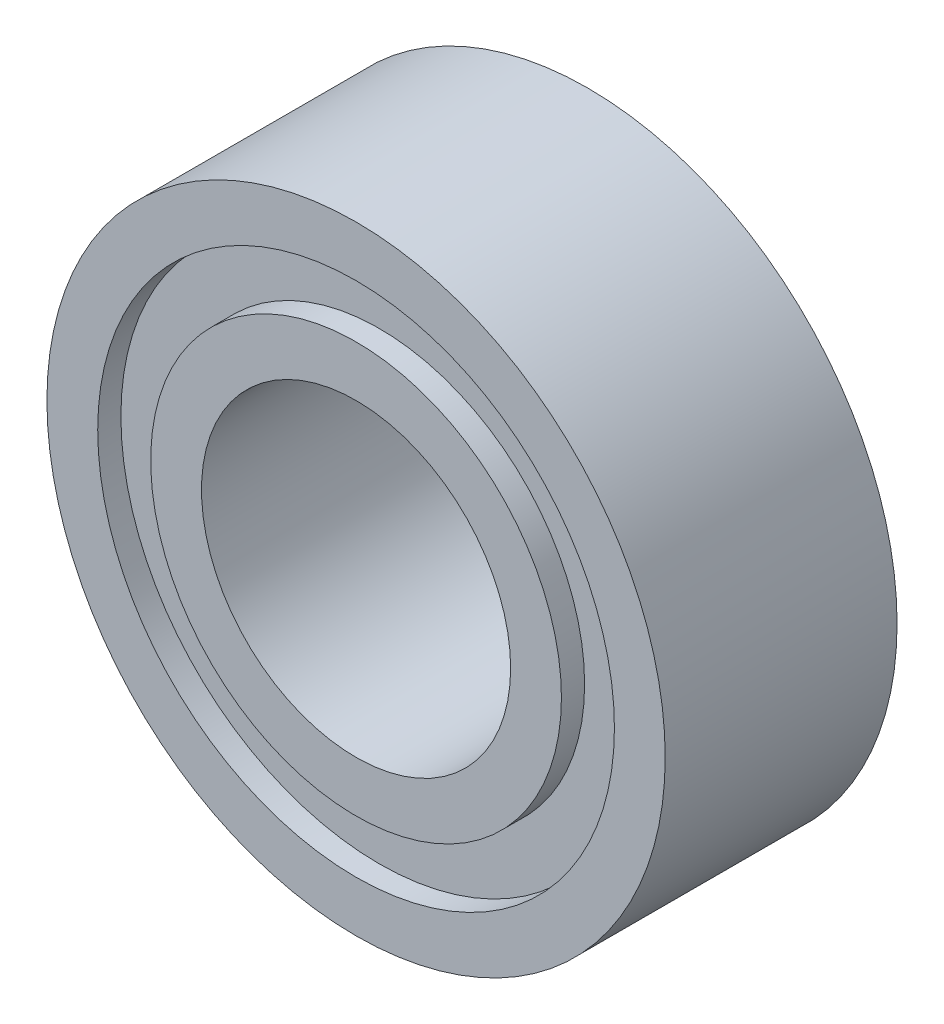
ISO-10303-21;
HEADER;
FILE_DESCRIPTION(('STEP AP214'),'2;1');
FILE_NAME('part.step','',(''),(''),'','','');
FILE_SCHEMA(('AUTOMOTIVE_DESIGN { 1 0 10303 214 1 1 1 1 }'));
ENDSEC;
DATA;
#1=APPLICATION_CONTEXT('core data for automotive mechanical design processes');
#2=APPLICATION_PROTOCOL_DEFINITION('international standard','automotive_design',2000,#1);
#3=PRODUCT_CONTEXT('',#1,'mechanical');
#4=PRODUCT('Part','Part','',(#3));
#5=PRODUCT_RELATED_PRODUCT_CATEGORY('part','',(#4));
#6=PRODUCT_DEFINITION_FORMATION('','',#4);
#7=PRODUCT_DEFINITION_CONTEXT('part definition',#1,'design');
#8=PRODUCT_DEFINITION('design','',#6,#7);
#9=PRODUCT_DEFINITION_SHAPE('','',#8);
#10=(LENGTH_UNIT() NAMED_UNIT(*) SI_UNIT(.MILLI.,.METRE.));
#11=(NAMED_UNIT(*) PLANE_ANGLE_UNIT() SI_UNIT($,.RADIAN.));
#12=(NAMED_UNIT(*) SI_UNIT($,.STERADIAN.) SOLID_ANGLE_UNIT());
#13=UNCERTAINTY_MEASURE_WITH_UNIT(LENGTH_MEASURE(1.E-05),#10,'distance_accuracy_value','');
#14=(GEOMETRIC_REPRESENTATION_CONTEXT(3) GLOBAL_UNCERTAINTY_ASSIGNED_CONTEXT((#13)) GLOBAL_UNIT_ASSIGNED_CONTEXT((#10,
#11,#12)) REPRESENTATION_CONTEXT('',''));
#15=CARTESIAN_POINT('',(0.,0.,0.));
#16=DIRECTION('',(0.,0.,1.));
#17=DIRECTION('',(1.,0.,0.));
#18=AXIS2_PLACEMENT_3D('',#15,#16,#17);
#19=CARTESIAN_POINT('',(0.,2.,1.5));
#20=DIRECTION('',(0.,0.,-1.));
#21=DIRECTION('',(-1.,0.,0.));
#22=AXIS2_PLACEMENT_3D('',#19,#20,#21);
#23=PLANE('',#22);
#24=CARTESIAN_POINT('',(0.,0.,1.5));
#25=DIRECTION('',(0.,0.,1.));
#26=DIRECTION('',(1.,0.,0.));
#27=AXIS2_PLACEMENT_3D('',#24,#25,#26);
#28=CIRCLE('',#27,2.);
#29=CARTESIAN_POINT('',(2.,0.,1.5));
#30=VERTEX_POINT('',#29);
#31=EDGE_CURVE('E100',#30,#30,#28,.T.);
#32=ORIENTED_EDGE('',*,*,#31,.F.);
#33=EDGE_LOOP('',(#32));
#34=FACE_BOUND('',#33,.T.);
#35=CARTESIAN_POINT('',(0.,0.,1.5));
#36=DIRECTION('',(0.,0.,1.));
#37=DIRECTION('',(1.,0.,0.));
#38=AXIS2_PLACEMENT_3D('',#35,#36,#37);
#39=CIRCLE('',#38,2.65714285714296);
#40=CARTESIAN_POINT('',(2.65714285714296,0.,1.5));
#41=VERTEX_POINT('',#40);
#42=EDGE_CURVE('E67',#41,#41,#39,.T.);
#43=ORIENTED_EDGE('',*,*,#42,.T.);
#44=EDGE_LOOP('',(#43));
#45=FACE_BOUND('',#44,.T.);
#46=ADVANCED_FACE('F34',(#34,#45),#23,.F.);
#47=CARTESIAN_POINT('',(0.,0.,0.));
#48=DIRECTION('',(0.,0.,1.));
#49=DIRECTION('',(1.,0.,0.));
#50=AXIS2_PLACEMENT_3D('',#47,#48,#49);
#51=CYLINDRICAL_SURFACE('',#50,2.65714285714296);
#52=ORIENTED_EDGE('',*,*,#42,.F.);
#53=EDGE_LOOP('',(#52));
#54=FACE_BOUND('',#53,.T.);
#55=CARTESIAN_POINT('',(0.,0.,1.2));
#56=DIRECTION('',(0.,0.,1.));
#57=DIRECTION('',(1.,0.,0.));
#58=AXIS2_PLACEMENT_3D('',#55,#56,#57);
#59=CIRCLE('',#58,2.65714285714296);
#60=CARTESIAN_POINT('',(2.65714285714296,0.,1.2));
#61=VERTEX_POINT('',#60);
#62=EDGE_CURVE('E70',#61,#61,#59,.T.);
#63=ORIENTED_EDGE('',*,*,#62,.T.);
#64=EDGE_LOOP('',(#63));
#65=FACE_BOUND('',#64,.T.);
#66=ADVANCED_FACE('F108',(#54,#65),#51,.T.);
#67=CARTESIAN_POINT('',(0.,3.34285714285704,1.2));
#68=DIRECTION('',(0.,0.,-1.));
#69=DIRECTION('',(-1.,0.,0.));
#70=AXIS2_PLACEMENT_3D('',#67,#68,#69);
#71=PLANE('',#70);
#72=ORIENTED_EDGE('',*,*,#62,.F.);
#73=EDGE_LOOP('',(#72));
#74=FACE_BOUND('',#73,.T.);
#75=CARTESIAN_POINT('',(0.,0.,1.2));
#76=DIRECTION('',(0.,0.,1.));
#77=DIRECTION('',(1.,0.,0.));
#78=AXIS2_PLACEMENT_3D('',#75,#76,#77);
#79=CIRCLE('',#78,3.34285714285704);
#80=CARTESIAN_POINT('',(3.34285714285704,0.,1.2));
#81=VERTEX_POINT('',#80);
#82=EDGE_CURVE('E73',#81,#81,#79,.T.);
#83=ORIENTED_EDGE('',*,*,#82,.T.);
#84=EDGE_LOOP('',(#83));
#85=FACE_BOUND('',#84,.T.);
#86=ADVANCED_FACE('F114',(#74,#85),#71,.F.);
#87=CARTESIAN_POINT('',(0.,0.,0.));
#88=DIRECTION('',(0.,0.,1.));
#89=DIRECTION('',(1.,0.,0.));
#90=AXIS2_PLACEMENT_3D('',#87,#88,#89);
#91=CYLINDRICAL_SURFACE('',#90,3.34285714285704);
#92=ORIENTED_EDGE('',*,*,#82,.F.);
#93=EDGE_LOOP('',(#92));
#94=FACE_BOUND('',#93,.T.);
#95=CARTESIAN_POINT('',(0.,0.,1.5));
#96=DIRECTION('',(0.,0.,1.));
#97=DIRECTION('',(1.,0.,0.));
#98=AXIS2_PLACEMENT_3D('',#95,#96,#97);
#99=CIRCLE('',#98,3.34285714285704);
#100=CARTESIAN_POINT('',(3.34285714285704,0.,1.5));
#101=VERTEX_POINT('',#100);
#102=EDGE_CURVE('E76',#101,#101,#99,.T.);
#103=ORIENTED_EDGE('',*,*,#102,.T.);
#104=EDGE_LOOP('',(#103));
#105=FACE_BOUND('',#104,.T.);
#106=ADVANCED_FACE('F120',(#94,#105),#91,.F.);
#107=CARTESIAN_POINT('',(0.,4.,1.5));
#108=DIRECTION('',(0.,0.,-1.));
#109=DIRECTION('',(-1.,0.,0.));
#110=AXIS2_PLACEMENT_3D('',#107,#108,#109);
#111=PLANE('',#110);
#112=ORIENTED_EDGE('',*,*,#102,.F.);
#113=EDGE_LOOP('',(#112));
#114=FACE_BOUND('',#113,.T.);
#115=CARTESIAN_POINT('',(0.,0.,1.5));
#116=DIRECTION('',(0.,0.,1.));
#117=DIRECTION('',(1.,0.,0.));
#118=AXIS2_PLACEMENT_3D('',#115,#116,#117);
#119=CIRCLE('',#118,4.);
#120=CARTESIAN_POINT('',(4.,0.,1.5));
#121=VERTEX_POINT('',#120);
#122=EDGE_CURVE('E79',#121,#121,#119,.T.);
#123=ORIENTED_EDGE('',*,*,#122,.T.);
#124=EDGE_LOOP('',(#123));
#125=FACE_BOUND('',#124,.T.);
#126=ADVANCED_FACE('F126',(#114,#125),#111,.F.);
#127=CARTESIAN_POINT('',(0.,0.,0.));
#128=DIRECTION('',(0.,0.,1.));
#129=DIRECTION('',(1.,0.,0.));
#130=AXIS2_PLACEMENT_3D('',#127,#128,#129);
#131=CYLINDRICAL_SURFACE('',#130,4.);
#132=ORIENTED_EDGE('',*,*,#122,.F.);
#133=EDGE_LOOP('',(#132));
#134=FACE_BOUND('',#133,.T.);
#135=CARTESIAN_POINT('',(0.,0.,-1.5));
#136=DIRECTION('',(0.,0.,1.));
#137=DIRECTION('',(1.,0.,0.));
#138=AXIS2_PLACEMENT_3D('',#135,#136,#137);
#139=CIRCLE('',#138,4.);
#140=CARTESIAN_POINT('',(4.,0.,-1.5));
#141=VERTEX_POINT('',#140);
#142=EDGE_CURVE('E82',#141,#141,#139,.T.);
#143=ORIENTED_EDGE('',*,*,#142,.T.);
#144=EDGE_LOOP('',(#143));
#145=FACE_BOUND('',#144,.T.);
#146=ADVANCED_FACE('F132',(#134,#145),#131,.T.);
#147=CARTESIAN_POINT('',(0.,3.34285714285704,-1.5));
#148=DIRECTION('',(0.,0.,1.));
#149=DIRECTION('',(1.,0.,0.));
#150=AXIS2_PLACEMENT_3D('',#147,#148,#149);
#151=PLANE('',#150);
#152=ORIENTED_EDGE('',*,*,#142,.F.);
#153=EDGE_LOOP('',(#152));
#154=FACE_BOUND('',#153,.T.);
#155=CARTESIAN_POINT('',(0.,0.,-1.5));
#156=DIRECTION('',(0.,0.,1.));
#157=DIRECTION('',(1.,0.,0.));
#158=AXIS2_PLACEMENT_3D('',#155,#156,#157);
#159=CIRCLE('',#158,3.34285714285704);
#160=CARTESIAN_POINT('',(3.34285714285704,0.,-1.5));
#161=VERTEX_POINT('',#160);
#162=EDGE_CURVE('E85',#161,#161,#159,.T.);
#163=ORIENTED_EDGE('',*,*,#162,.T.);
#164=EDGE_LOOP('',(#163));
#165=FACE_BOUND('',#164,.T.);
#166=ADVANCED_FACE('F138',(#154,#165),#151,.F.);
#167=CARTESIAN_POINT('',(0.,0.,0.));
#168=DIRECTION('',(0.,0.,1.));
#169=DIRECTION('',(1.,0.,0.));
#170=AXIS2_PLACEMENT_3D('',#167,#168,#169);
#171=CYLINDRICAL_SURFACE('',#170,3.34285714285704);
#172=ORIENTED_EDGE('',*,*,#162,.F.);
#173=EDGE_LOOP('',(#172));
#174=FACE_BOUND('',#173,.T.);
#175=CARTESIAN_POINT('',(0.,0.,-1.2));
#176=DIRECTION('',(0.,0.,1.));
#177=DIRECTION('',(1.,0.,0.));
#178=AXIS2_PLACEMENT_3D('',#175,#176,#177);
#179=CIRCLE('',#178,3.34285714285704);
#180=CARTESIAN_POINT('',(3.34285714285704,0.,-1.2));
#181=VERTEX_POINT('',#180);
#182=EDGE_CURVE('E88',#181,#181,#179,.T.);
#183=ORIENTED_EDGE('',*,*,#182,.T.);
#184=EDGE_LOOP('',(#183));
#185=FACE_BOUND('',#184,.T.);
#186=ADVANCED_FACE('F144',(#174,#185),#171,.F.);
#187=CARTESIAN_POINT('',(0.,3.34285714285704,-1.2));
#188=DIRECTION('',(0.,0.,1.));
#189=DIRECTION('',(1.,0.,0.));
#190=AXIS2_PLACEMENT_3D('',#187,#188,#189);
#191=PLANE('',#190);
#192=ORIENTED_EDGE('',*,*,#182,.F.);
#193=EDGE_LOOP('',(#192));
#194=FACE_BOUND('',#193,.T.);
#195=CARTESIAN_POINT('',(0.,0.,-1.2));
#196=DIRECTION('',(0.,0.,1.));
#197=DIRECTION('',(1.,0.,0.));
#198=AXIS2_PLACEMENT_3D('',#195,#196,#197);
#199=CIRCLE('',#198,2.65714285714296);
#200=CARTESIAN_POINT('',(2.65714285714296,0.,-1.2));
#201=VERTEX_POINT('',#200);
#202=EDGE_CURVE('E91',#201,#201,#199,.T.);
#203=ORIENTED_EDGE('',*,*,#202,.T.);
#204=EDGE_LOOP('',(#203));
#205=FACE_BOUND('',#204,.T.);
#206=ADVANCED_FACE('F150',(#194,#205),#191,.F.);
#207=CARTESIAN_POINT('',(0.,0.,0.));
#208=DIRECTION('',(0.,0.,1.));
#209=DIRECTION('',(1.,0.,0.));
#210=AXIS2_PLACEMENT_3D('',#207,#208,#209);
#211=CYLINDRICAL_SURFACE('',#210,2.65714285714296);
#212=ORIENTED_EDGE('',*,*,#202,.F.);
#213=EDGE_LOOP('',(#212));
#214=FACE_BOUND('',#213,.T.);
#215=CARTESIAN_POINT('',(0.,0.,-1.5));
#216=DIRECTION('',(0.,0.,1.));
#217=DIRECTION('',(1.,0.,0.));
#218=AXIS2_PLACEMENT_3D('',#215,#216,#217);
#219=CIRCLE('',#218,2.65714285714296);
#220=CARTESIAN_POINT('',(2.65714285714296,0.,-1.5));
#221=VERTEX_POINT('',#220);
#222=EDGE_CURVE('E94',#221,#221,#219,.T.);
#223=ORIENTED_EDGE('',*,*,#222,.T.);
#224=EDGE_LOOP('',(#223));
#225=FACE_BOUND('',#224,.T.);
#226=ADVANCED_FACE('F156',(#214,#225),#211,.T.);
#227=CARTESIAN_POINT('',(0.,2.65714285714296,-1.5));
#228=DIRECTION('',(0.,0.,1.));
#229=DIRECTION('',(1.,0.,0.));
#230=AXIS2_PLACEMENT_3D('',#227,#228,#229);
#231=PLANE('',#230);
#232=ORIENTED_EDGE('',*,*,#222,.F.);
#233=EDGE_LOOP('',(#232));
#234=FACE_BOUND('',#233,.T.);
#235=CARTESIAN_POINT('',(0.,0.,-1.5));
#236=DIRECTION('',(0.,0.,1.));
#237=DIRECTION('',(1.,0.,0.));
#238=AXIS2_PLACEMENT_3D('',#235,#236,#237);
#239=CIRCLE('',#238,2.);
#240=CARTESIAN_POINT('',(2.,0.,-1.5));
#241=VERTEX_POINT('',#240);
#242=EDGE_CURVE('E97',#241,#241,#239,.T.);
#243=ORIENTED_EDGE('',*,*,#242,.T.);
#244=EDGE_LOOP('',(#243));
#245=FACE_BOUND('',#244,.T.);
#246=ADVANCED_FACE('F162',(#234,#245),#231,.F.);
#247=CARTESIAN_POINT('',(0.,0.,0.));
#248=DIRECTION('',(0.,0.,1.));
#249=DIRECTION('',(1.,0.,0.));
#250=AXIS2_PLACEMENT_3D('',#247,#248,#249);
#251=CYLINDRICAL_SURFACE('',#250,2.);
#252=ORIENTED_EDGE('',*,*,#242,.F.);
#253=EDGE_LOOP('',(#252));
#254=FACE_BOUND('',#253,.T.);
#255=ORIENTED_EDGE('',*,*,#31,.T.);
#256=EDGE_LOOP('',(#255));
#257=FACE_BOUND('',#256,.T.);
#258=ADVANCED_FACE('F104',(#254,#257),#251,.F.);
#259=CLOSED_SHELL('',(#46,#66,#86,#106,#126,#146,#166,#186,#206,#226,#246,#258));
#260=CARTESIAN_POINT('',(0.,0.,0.));
#261=DIRECTION('',(0.,0.,1.));
#262=DIRECTION('',(1.,0.,0.));
#263=AXIS2_PLACEMENT_3D('',#260,#261,#262);
#264=TOROIDAL_SURFACE('',#263,3.,0.6);
#265=CARTESIAN_POINT('',(0.,0.,-0.492391083989049));
#266=DIRECTION('',(0.,0.,1.));
#267=DIRECTION('',(1.,0.,0.));
#268=AXIS2_PLACEMENT_3D('',#265,#266,#267);
#269=CIRCLE('',#268,2.65714285714296);
#270=CARTESIAN_POINT('',(2.65714285714296,0.,-0.492391083989049));
#271=VERTEX_POINT('',#270);
#272=EDGE_CURVE('E10',#271,#271,#269,.T.);
#273=ORIENTED_EDGE('',*,*,#272,.T.);
#274=EDGE_LOOP('',(#273));
#275=FACE_BOUND('',#274,.T.);
#276=CARTESIAN_POINT('',(0.,0.,0.492391083989049));
#277=DIRECTION('',(0.,0.,1.));
#278=DIRECTION('',(1.,0.,0.));
#279=AXIS2_PLACEMENT_3D('',#276,#277,#278);
#280=CIRCLE('',#279,2.65714285714296);
#281=CARTESIAN_POINT('',(2.65714285714296,0.,0.492391083989049));
#282=VERTEX_POINT('',#281);
#283=EDGE_CURVE('E64',#282,#282,#280,.T.);
#284=ORIENTED_EDGE('',*,*,#283,.F.);
#285=EDGE_LOOP('',(#284));
#286=FACE_BOUND('',#285,.T.);
#287=ADVANCED_FACE('F36',(#275,#286),#264,.F.);
#288=CARTESIAN_POINT('',(0.,0.,0.));
#289=DIRECTION('',(0.,0.,1.));
#290=DIRECTION('',(1.,0.,0.));
#291=AXIS2_PLACEMENT_3D('',#288,#289,#290);
#292=CYLINDRICAL_SURFACE('',#291,2.65714285714296);
#293=CARTESIAN_POINT('',(0.,0.,-0.999999999999999));
#294=DIRECTION('',(0.,0.,1.));
#295=DIRECTION('',(1.,0.,0.));
#296=AXIS2_PLACEMENT_3D('',#293,#294,#295);
#297=CIRCLE('',#296,2.65714285714296);
#298=CARTESIAN_POINT('',(2.65714285714296,0.,-0.999999999999999));
#299=VERTEX_POINT('',#298);
#300=EDGE_CURVE('E42',#299,#299,#297,.T.);
#301=ORIENTED_EDGE('',*,*,#300,.T.);
#302=EDGE_LOOP('',(#301));
#303=FACE_BOUND('',#302,.T.);
#304=ORIENTED_EDGE('',*,*,#272,.F.);
#305=EDGE_LOOP('',(#304));
#306=FACE_BOUND('',#305,.T.);
#307=ADVANCED_FACE('F200',(#303,#306),#292,.T.);
#308=CARTESIAN_POINT('',(0.,3.34285714285704,-0.999999999999999));
#309=DIRECTION('',(0.,0.,1.));
#310=DIRECTION('',(1.,0.,0.));
#311=AXIS2_PLACEMENT_3D('',#308,#309,#310);
#312=PLANE('',#311);
#313=CARTESIAN_POINT('',(0.,0.,-0.999999999999999));
#314=DIRECTION('',(0.,0.,1.));
#315=DIRECTION('',(1.,0.,0.));
#316=AXIS2_PLACEMENT_3D('',#313,#314,#315);
#317=CIRCLE('',#316,3.34285714285704);
#318=CARTESIAN_POINT('',(3.34285714285704,0.,-0.999999999999999));
#319=VERTEX_POINT('',#318);
#320=EDGE_CURVE('E46',#319,#319,#317,.T.);
#321=ORIENTED_EDGE('',*,*,#320,.T.);
#322=EDGE_LOOP('',(#321));
#323=FACE_BOUND('',#322,.T.);
#324=ORIENTED_EDGE('',*,*,#300,.F.);
#325=EDGE_LOOP('',(#324));
#326=FACE_BOUND('',#325,.T.);
#327=ADVANCED_FACE('F197',(#323,#326),#312,.T.);
#328=CARTESIAN_POINT('',(0.,0.,0.));
#329=DIRECTION('',(0.,0.,1.));
#330=DIRECTION('',(1.,0.,0.));
#331=AXIS2_PLACEMENT_3D('',#328,#329,#330);
#332=CYLINDRICAL_SURFACE('',#331,3.34285714285704);
#333=CARTESIAN_POINT('',(0.,0.,-0.492391083989049));
#334=DIRECTION('',(0.,0.,1.));
#335=DIRECTION('',(1.,0.,0.));
#336=AXIS2_PLACEMENT_3D('',#333,#334,#335);
#337=CIRCLE('',#336,3.34285714285704);
#338=CARTESIAN_POINT('',(3.34285714285704,0.,-0.492391083989049));
#339=VERTEX_POINT('',#338);
#340=EDGE_CURVE('E50',#339,#339,#337,.T.);
#341=ORIENTED_EDGE('',*,*,#340,.T.);
#342=EDGE_LOOP('',(#341));
#343=FACE_BOUND('',#342,.T.);
#344=ORIENTED_EDGE('',*,*,#320,.F.);
#345=EDGE_LOOP('',(#344));
#346=FACE_BOUND('',#345,.T.);
#347=ADVANCED_FACE('F193',(#343,#346),#332,.F.);
#348=CARTESIAN_POINT('',(0.,0.,0.));
#349=DIRECTION('',(0.,0.,1.));
#350=DIRECTION('',(1.,0.,0.));
#351=AXIS2_PLACEMENT_3D('',#348,#349,#350);
#352=TOROIDAL_SURFACE('',#351,3.,0.6);
#353=CARTESIAN_POINT('',(0.,0.,0.492391083989049));
#354=DIRECTION('',(0.,0.,1.));
#355=DIRECTION('',(1.,0.,0.));
#356=AXIS2_PLACEMENT_3D('',#353,#354,#355);
#357=CIRCLE('',#356,3.34285714285704);
#358=CARTESIAN_POINT('',(3.34285714285704,0.,0.492391083989049));
#359=VERTEX_POINT('',#358);
#360=EDGE_CURVE('E55',#359,#359,#357,.T.);
#361=ORIENTED_EDGE('',*,*,#360,.T.);
#362=EDGE_LOOP('',(#361));
#363=FACE_BOUND('',#362,.T.);
#364=ORIENTED_EDGE('',*,*,#340,.F.);
#365=EDGE_LOOP('',(#364));
#366=FACE_BOUND('',#365,.T.);
#367=ADVANCED_FACE('F189',(#363,#366),#352,.F.);
#368=CARTESIAN_POINT('',(0.,0.,0.));
#369=DIRECTION('',(0.,0.,1.));
#370=DIRECTION('',(1.,0.,0.));
#371=AXIS2_PLACEMENT_3D('',#368,#369,#370);
#372=CYLINDRICAL_SURFACE('',#371,3.34285714285704);
#373=CARTESIAN_POINT('',(0.,0.,1.));
#374=DIRECTION('',(0.,0.,1.));
#375=DIRECTION('',(1.,0.,0.));
#376=AXIS2_PLACEMENT_3D('',#373,#374,#375);
#377=CIRCLE('',#376,3.34285714285704);
#378=CARTESIAN_POINT('',(3.34285714285704,0.,1.));
#379=VERTEX_POINT('',#378);
#380=EDGE_CURVE('E58',#379,#379,#377,.T.);
#381=ORIENTED_EDGE('',*,*,#380,.T.);
#382=EDGE_LOOP('',(#381));
#383=FACE_BOUND('',#382,.T.);
#384=ORIENTED_EDGE('',*,*,#360,.F.);
#385=EDGE_LOOP('',(#384));
#386=FACE_BOUND('',#385,.T.);
#387=ADVANCED_FACE('F185',(#383,#386),#372,.F.);
#388=CARTESIAN_POINT('',(0.,3.34285714285704,1.));
#389=DIRECTION('',(0.,0.,-1.));
#390=DIRECTION('',(-1.,0.,0.));
#391=AXIS2_PLACEMENT_3D('',#388,#389,#390);
#392=PLANE('',#391);
#393=CARTESIAN_POINT('',(0.,0.,1.));
#394=DIRECTION('',(0.,0.,1.));
#395=DIRECTION('',(1.,0.,0.));
#396=AXIS2_PLACEMENT_3D('',#393,#394,#395);
#397=CIRCLE('',#396,2.65714285714296);
#398=CARTESIAN_POINT('',(2.65714285714296,0.,1.));
#399=VERTEX_POINT('',#398);
#400=EDGE_CURVE('E61',#399,#399,#397,.T.);
#401=ORIENTED_EDGE('',*,*,#400,.T.);
#402=EDGE_LOOP('',(#401));
#403=FACE_BOUND('',#402,.T.);
#404=ORIENTED_EDGE('',*,*,#380,.F.);
#405=EDGE_LOOP('',(#404));
#406=FACE_BOUND('',#405,.T.);
#407=ADVANCED_FACE('F180',(#403,#406),#392,.T.);
#408=CARTESIAN_POINT('',(0.,0.,0.));
#409=DIRECTION('',(0.,0.,1.));
#410=DIRECTION('',(1.,0.,0.));
#411=AXIS2_PLACEMENT_3D('',#408,#409,#410);
#412=CYLINDRICAL_SURFACE('',#411,2.65714285714296);
#413=ORIENTED_EDGE('',*,*,#283,.T.);
#414=EDGE_LOOP('',(#413));
#415=FACE_BOUND('',#414,.T.);
#416=ORIENTED_EDGE('',*,*,#400,.F.);
#417=EDGE_LOOP('',(#416));
#418=FACE_BOUND('',#417,.T.);
#419=ADVANCED_FACE('F177',(#415,#418),#412,.T.);
#420=CLOSED_SHELL('',(#287,#307,#327,#347,#367,#387,#407,#419));
#421=ORIENTED_CLOSED_SHELL('',*,#420,.T.);
#422=BREP_WITH_VOIDS('B2',#259,(#421));
#423=ADVANCED_BREP_SHAPE_REPRESENTATION('',(#18,#422),#14);
#424=SHAPE_DEFINITION_REPRESENTATION(#9,#423);
ENDSEC;
END-ISO-10303-21;
